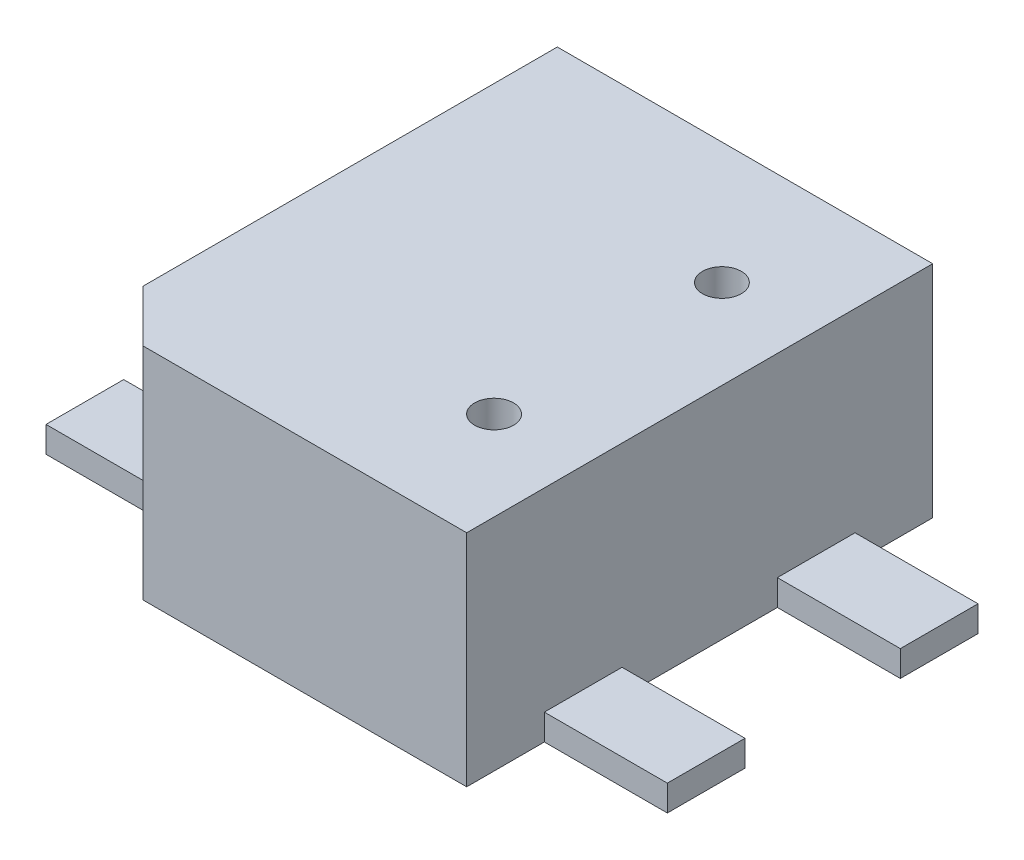
ISO-10303-21;
HEADER;
FILE_DESCRIPTION(('STEP AP214'),'2;1');
FILE_NAME('part.step','',(''),(''),'','','');
FILE_SCHEMA(('AUTOMOTIVE_DESIGN { 1 0 10303 214 1 1 1 1 }'));
ENDSEC;
DATA;
#1=APPLICATION_CONTEXT('core data for automotive mechanical design processes');
#2=APPLICATION_PROTOCOL_DEFINITION('international standard','automotive_design',2000,#1);
#3=PRODUCT_CONTEXT('',#1,'mechanical');
#4=PRODUCT('Part','Part','',(#3));
#5=PRODUCT_RELATED_PRODUCT_CATEGORY('part','',(#4));
#6=PRODUCT_DEFINITION_FORMATION('','',#4);
#7=PRODUCT_DEFINITION_CONTEXT('part definition',#1,'design');
#8=PRODUCT_DEFINITION('design','',#6,#7);
#9=PRODUCT_DEFINITION_SHAPE('','',#8);
#10=(LENGTH_UNIT() NAMED_UNIT(*) SI_UNIT(.MILLI.,.METRE.));
#11=(NAMED_UNIT(*) PLANE_ANGLE_UNIT() SI_UNIT($,.RADIAN.));
#12=(NAMED_UNIT(*) SI_UNIT($,.STERADIAN.) SOLID_ANGLE_UNIT());
#13=UNCERTAINTY_MEASURE_WITH_UNIT(LENGTH_MEASURE(1.E-05),#10,'distance_accuracy_value','');
#14=(GEOMETRIC_REPRESENTATION_CONTEXT(3) GLOBAL_UNCERTAINTY_ASSIGNED_CONTEXT((#13)) GLOBAL_UNIT_ASSIGNED_CONTEXT((#10,
#11,#12)) REPRESENTATION_CONTEXT('',''));
#15=CARTESIAN_POINT('',(0.,0.,0.));
#16=DIRECTION('',(0.,0.,1.));
#17=DIRECTION('',(1.,0.,0.));
#18=AXIS2_PLACEMENT_3D('',#15,#16,#17);
#19=CARTESIAN_POINT('',(-1.45,1.7,-1.8));
#20=DIRECTION('',(1.,0.,0.));
#21=DIRECTION('',(0.,0.,-1.));
#22=AXIS2_PLACEMENT_3D('',#19,#20,#21);
#23=PLANE('',#22);
#24=DIRECTION('',(0.,0.,1.));
#25=VECTOR('',#24,1.);
#26=CARTESIAN_POINT('',(-1.45,0.2,-1.8));
#27=LINE('',#26,#25);
#28=CARTESIAN_POINT('',(-1.45,0.2,0.599999999995748));
#29=VERTEX_POINT('',#28);
#30=CARTESIAN_POINT('',(-1.45,0.2,1.20000000000571));
#31=VERTEX_POINT('',#30);
#32=EDGE_CURVE('E46',#29,#31,#27,.T.);
#33=ORIENTED_EDGE('',*,*,#32,.T.);
#34=DIRECTION('',(0.,-1.,0.));
#35=VECTOR('',#34,1.);
#36=CARTESIAN_POINT('',(-1.45,1.7,1.20000000000571));
#37=LINE('',#36,#35);
#38=CARTESIAN_POINT('',(-1.45,0.,1.20000000000571));
#39=VERTEX_POINT('',#38);
#40=EDGE_CURVE('E230',#31,#39,#37,.T.);
#41=ORIENTED_EDGE('',*,*,#40,.T.);
#42=DIRECTION('',(0.,0.,1.));
#43=VECTOR('',#42,1.);
#44=CARTESIAN_POINT('',(-1.45,0.,-1.8));
#45=LINE('',#44,#43);
#46=CARTESIAN_POINT('',(-1.45,0.,1.40047429049327));
#47=VERTEX_POINT('',#46);
#48=EDGE_CURVE('E291',#39,#47,#45,.T.);
#49=ORIENTED_EDGE('',*,*,#48,.T.);
#50=DIRECTION('',(0.,1.,0.));
#51=VECTOR('',#50,1.);
#52=CARTESIAN_POINT('',(-1.45,1.7,1.40047429049327));
#53=LINE('',#52,#51);
#54=CARTESIAN_POINT('',(-1.45,1.7,1.40047429049327));
#55=VERTEX_POINT('',#54);
#56=EDGE_CURVE('E288',#47,#55,#53,.T.);
#57=ORIENTED_EDGE('',*,*,#56,.T.);
#58=DIRECTION('',(0.,0.,1.));
#59=VECTOR('',#58,1.);
#60=CARTESIAN_POINT('',(-1.45,1.7,-1.8));
#61=LINE('',#60,#59);
#62=CARTESIAN_POINT('',(-1.45,1.7,-1.8));
#63=VERTEX_POINT('',#62);
#64=EDGE_CURVE('E292',#63,#55,#61,.T.);
#65=ORIENTED_EDGE('',*,*,#64,.F.);
#66=DIRECTION('',(0.,-1.,0.));
#67=VECTOR('',#66,1.);
#68=CARTESIAN_POINT('',(-1.45,1.7,-1.8));
#69=LINE('',#68,#67);
#70=CARTESIAN_POINT('',(-1.45,0.,-1.8));
#71=VERTEX_POINT('',#70);
#72=EDGE_CURVE('E302',#63,#71,#69,.T.);
#73=ORIENTED_EDGE('',*,*,#72,.T.);
#74=CARTESIAN_POINT('',(-1.45,0.,-1.20000000000571));
#75=VERTEX_POINT('',#74);
#76=EDGE_CURVE('E303',#71,#75,#45,.T.);
#77=ORIENTED_EDGE('',*,*,#76,.T.);
#78=DIRECTION('',(0.,1.,0.));
#79=VECTOR('',#78,1.);
#80=CARTESIAN_POINT('',(-1.45,1.7,-1.20000000000571));
#81=LINE('',#80,#79);
#82=CARTESIAN_POINT('',(-1.45,0.2,-1.20000000000571));
#83=VERTEX_POINT('',#82);
#84=EDGE_CURVE('E274',#75,#83,#81,.T.);
#85=ORIENTED_EDGE('',*,*,#84,.T.);
#86=DIRECTION('',(0.,0.,1.));
#87=VECTOR('',#86,1.);
#88=CARTESIAN_POINT('',(-1.45,0.2,-1.8));
#89=LINE('',#88,#87);
#90=CARTESIAN_POINT('',(-1.45,0.2,-0.599999999995748));
#91=VERTEX_POINT('',#90);
#92=EDGE_CURVE('E281',#83,#91,#89,.T.);
#93=ORIENTED_EDGE('',*,*,#92,.T.);
#94=DIRECTION('',(0.,-1.,0.));
#95=VECTOR('',#94,1.);
#96=CARTESIAN_POINT('',(-1.45,1.7,-0.599999999995748));
#97=LINE('',#96,#95);
#98=CARTESIAN_POINT('',(-1.45,0.,-0.599999999995748));
#99=VERTEX_POINT('',#98);
#100=EDGE_CURVE('E278',#91,#99,#97,.T.);
#101=ORIENTED_EDGE('',*,*,#100,.T.);
#102=CARTESIAN_POINT('',(-1.45,0.,0.599999999995747));
#103=VERTEX_POINT('',#102);
#104=EDGE_CURVE('E306',#99,#103,#45,.T.);
#105=ORIENTED_EDGE('',*,*,#104,.T.);
#106=DIRECTION('',(0.,1.,0.));
#107=VECTOR('',#106,1.);
#108=CARTESIAN_POINT('',(-1.45,1.7,0.599999999995748));
#109=LINE('',#108,#107);
#110=EDGE_CURVE('E51',#103,#29,#109,.T.);
#111=ORIENTED_EDGE('',*,*,#110,.T.);
#112=EDGE_LOOP('',(#33,#41,#49,#57,#65,#73,#77,#85,#93,#101,#105,#111));
#113=FACE_BOUND('',#112,.T.);
#114=ADVANCED_FACE('F32',(#113),#23,.F.);
#115=CARTESIAN_POINT('',(-1.45,1.7,1.8));
#116=DIRECTION('',(0.,0.,-1.));
#117=DIRECTION('',(-1.,0.,0.));
#118=AXIS2_PLACEMENT_3D('',#115,#116,#117);
#119=PLANE('',#118);
#120=DIRECTION('',(1.,0.,0.));
#121=VECTOR('',#120,1.);
#122=CARTESIAN_POINT('',(-1.45,1.7,1.8));
#123=LINE('',#122,#121);
#124=CARTESIAN_POINT('',(-1.05047429049198,1.7,1.8));
#125=VERTEX_POINT('',#124);
#126=CARTESIAN_POINT('',(1.45,1.7,1.8));
#127=VERTEX_POINT('',#126);
#128=EDGE_CURVE('E295',#125,#127,#123,.T.);
#129=ORIENTED_EDGE('',*,*,#128,.F.);
#130=DIRECTION('',(0.,-1.,0.));
#131=VECTOR('',#130,1.);
#132=CARTESIAN_POINT('',(-1.05047429049198,1.7,1.8));
#133=LINE('',#132,#131);
#134=CARTESIAN_POINT('',(-1.05047429049198,0.,1.8));
#135=VERTEX_POINT('',#134);
#136=EDGE_CURVE('E285',#125,#135,#133,.T.);
#137=ORIENTED_EDGE('',*,*,#136,.T.);
#138=DIRECTION('',(1.,0.,0.));
#139=VECTOR('',#138,1.);
#140=CARTESIAN_POINT('',(-1.45,0.,1.8));
#141=LINE('',#140,#139);
#142=CARTESIAN_POINT('',(1.45,0.,1.8));
#143=VERTEX_POINT('',#142);
#144=EDGE_CURVE('E305',#135,#143,#141,.T.);
#145=ORIENTED_EDGE('',*,*,#144,.T.);
#146=DIRECTION('',(0.,-1.,0.));
#147=VECTOR('',#146,1.);
#148=CARTESIAN_POINT('',(1.45,1.7,1.8));
#149=LINE('',#148,#147);
#150=EDGE_CURVE('E318',#127,#143,#149,.T.);
#151=ORIENTED_EDGE('',*,*,#150,.F.);
#152=EDGE_LOOP('',(#129,#137,#145,#151));
#153=FACE_BOUND('',#152,.T.);
#154=ADVANCED_FACE('F361',(#153),#119,.F.);
#155=CARTESIAN_POINT('',(1.45,1.7,-1.8));
#156=DIRECTION('',(-1.,0.,0.));
#157=DIRECTION('',(0.,0.,1.));
#158=AXIS2_PLACEMENT_3D('',#155,#156,#157);
#159=PLANE('',#158);
#160=DIRECTION('',(0.,0.,-1.));
#161=VECTOR('',#160,1.);
#162=CARTESIAN_POINT('',(1.45,0.,-1.8));
#163=LINE('',#162,#161);
#164=CARTESIAN_POINT('',(1.45,0.,1.20000000000571));
#165=VERTEX_POINT('',#164);
#166=EDGE_CURVE('E309',#143,#165,#163,.T.);
#167=ORIENTED_EDGE('',*,*,#166,.T.);
#168=DIRECTION('',(0.,1.,0.));
#169=VECTOR('',#168,1.);
#170=CARTESIAN_POINT('',(1.45,1.7,1.20000000000571));
#171=LINE('',#170,#169);
#172=CARTESIAN_POINT('',(1.45,0.2,1.20000000000571));
#173=VERTEX_POINT('',#172);
#174=EDGE_CURVE('E228',#165,#173,#171,.T.);
#175=ORIENTED_EDGE('',*,*,#174,.T.);
#176=DIRECTION('',(0.,0.,-1.));
#177=VECTOR('',#176,1.);
#178=CARTESIAN_POINT('',(1.45,0.2,-1.8));
#179=LINE('',#178,#177);
#180=CARTESIAN_POINT('',(1.45,0.2,0.599999999995748));
#181=VERTEX_POINT('',#180);
#182=EDGE_CURVE('E11',#173,#181,#179,.T.);
#183=ORIENTED_EDGE('',*,*,#182,.T.);
#184=DIRECTION('',(0.,-1.,0.));
#185=VECTOR('',#184,1.);
#186=CARTESIAN_POINT('',(1.45,1.7,0.599999999995748));
#187=LINE('',#186,#185);
#188=CARTESIAN_POINT('',(1.45,0.,0.599999999995748));
#189=VERTEX_POINT('',#188);
#190=EDGE_CURVE('E220',#181,#189,#187,.T.);
#191=ORIENTED_EDGE('',*,*,#190,.T.);
#192=CARTESIAN_POINT('',(1.45,0.,-0.599999999995748));
#193=VERTEX_POINT('',#192);
#194=EDGE_CURVE('E311',#189,#193,#163,.T.);
#195=ORIENTED_EDGE('',*,*,#194,.T.);
#196=DIRECTION('',(0.,1.,0.));
#197=VECTOR('',#196,1.);
#198=CARTESIAN_POINT('',(1.45,1.7,-0.599999999995748));
#199=LINE('',#198,#197);
#200=CARTESIAN_POINT('',(1.45,0.2,-0.599999999995748));
#201=VERTEX_POINT('',#200);
#202=EDGE_CURVE('E276',#193,#201,#199,.T.);
#203=ORIENTED_EDGE('',*,*,#202,.T.);
#204=DIRECTION('',(0.,0.,-1.));
#205=VECTOR('',#204,1.);
#206=CARTESIAN_POINT('',(1.45,0.2,-1.8));
#207=LINE('',#206,#205);
#208=CARTESIAN_POINT('',(1.45,0.2,-1.20000000000571));
#209=VERTEX_POINT('',#208);
#210=EDGE_CURVE('E39',#201,#209,#207,.T.);
#211=ORIENTED_EDGE('',*,*,#210,.T.);
#212=DIRECTION('',(0.,-1.,0.));
#213=VECTOR('',#212,1.);
#214=CARTESIAN_POINT('',(1.45,1.7,-1.20000000000571));
#215=LINE('',#214,#213);
#216=CARTESIAN_POINT('',(1.45,0.,-1.20000000000571));
#217=VERTEX_POINT('',#216);
#218=EDGE_CURVE('E265',#209,#217,#215,.T.);
#219=ORIENTED_EDGE('',*,*,#218,.T.);
#220=CARTESIAN_POINT('',(1.45,0.,-1.8));
#221=VERTEX_POINT('',#220);
#222=EDGE_CURVE('E308',#217,#221,#163,.T.);
#223=ORIENTED_EDGE('',*,*,#222,.T.);
#224=DIRECTION('',(0.,-1.,0.));
#225=VECTOR('',#224,1.);
#226=CARTESIAN_POINT('',(1.45,1.7,-1.8));
#227=LINE('',#226,#225);
#228=CARTESIAN_POINT('',(1.45,1.7,-1.8));
#229=VERTEX_POINT('',#228);
#230=EDGE_CURVE('E315',#229,#221,#227,.T.);
#231=ORIENTED_EDGE('',*,*,#230,.F.);
#232=DIRECTION('',(0.,0.,-1.));
#233=VECTOR('',#232,1.);
#234=CARTESIAN_POINT('',(1.45,1.7,-1.8));
#235=LINE('',#234,#233);
#236=EDGE_CURVE('E298',#127,#229,#235,.T.);
#237=ORIENTED_EDGE('',*,*,#236,.F.);
#238=ORIENTED_EDGE('',*,*,#150,.T.);
#239=EDGE_LOOP('',(#167,#175,#183,#191,#195,#203,#211,#219,#223,#231,#237,#238));
#240=FACE_BOUND('',#239,.T.);
#241=ADVANCED_FACE('F326',(#240),#159,.F.);
#242=CARTESIAN_POINT('',(-1.45,1.7,-1.8));
#243=DIRECTION('',(0.,0.,1.));
#244=DIRECTION('',(1.,0.,0.));
#245=AXIS2_PLACEMENT_3D('',#242,#243,#244);
#246=PLANE('',#245);
#247=DIRECTION('',(-1.,0.,0.));
#248=VECTOR('',#247,1.);
#249=CARTESIAN_POINT('',(-1.45,0.,-1.8));
#250=LINE('',#249,#248);
#251=EDGE_CURVE('E296',#221,#71,#250,.T.);
#252=ORIENTED_EDGE('',*,*,#251,.T.);
#253=ORIENTED_EDGE('',*,*,#72,.F.);
#254=DIRECTION('',(-1.,0.,0.));
#255=VECTOR('',#254,1.);
#256=CARTESIAN_POINT('',(-1.45,1.7,-1.8));
#257=LINE('',#256,#255);
#258=EDGE_CURVE('E300',#229,#63,#257,.T.);
#259=ORIENTED_EDGE('',*,*,#258,.F.);
#260=ORIENTED_EDGE('',*,*,#230,.T.);
#261=EDGE_LOOP('',(#252,#253,#259,#260));
#262=FACE_BOUND('',#261,.T.);
#263=ADVANCED_FACE('F371',(#262),#246,.F.);
#264=CARTESIAN_POINT('',(0.,1.7,0.));
#265=DIRECTION('',(0.,1.,0.));
#266=DIRECTION('',(0.,0.,1.));
#267=AXIS2_PLACEMENT_3D('',#264,#265,#266);
#268=PLANE('',#267);
#269=CARTESIAN_POINT('',(0.761620279617557,1.7,0.900000000000728));
#270=DIRECTION('',(0.,1.,0.));
#271=DIRECTION('',(0.,0.,1.));
#272=AXIS2_PLACEMENT_3D('',#269,#270,#271);
#273=CIRCLE('',#272,0.15);
#274=CARTESIAN_POINT('',(0.761620279617557,1.7,1.05000000000073));
#275=VERTEX_POINT('',#274);
#276=EDGE_CURVE('E433',#275,#275,#273,.T.);
#277=ORIENTED_EDGE('',*,*,#276,.F.);
#278=EDGE_LOOP('',(#277));
#279=FACE_BOUND('',#278,.T.);
#280=CARTESIAN_POINT('',(0.761620279617557,1.7,-0.86));
#281=DIRECTION('',(0.,1.,0.));
#282=DIRECTION('',(0.,0.,1.));
#283=AXIS2_PLACEMENT_3D('',#280,#281,#282);
#284=CIRCLE('',#283,0.15);
#285=CARTESIAN_POINT('',(0.761620279617557,1.7,-0.71));
#286=VERTEX_POINT('',#285);
#287=EDGE_CURVE('E203',#286,#286,#284,.T.);
#288=ORIENTED_EDGE('',*,*,#287,.F.);
#289=EDGE_LOOP('',(#288));
#290=FACE_BOUND('',#289,.T.);
#291=DIRECTION('',(-0.707106781187696,0.,-0.707106781185399));
#292=VECTOR('',#291,1.);
#293=CARTESIAN_POINT('',(-1.45047429049328,1.7,1.4));
#294=LINE('',#293,#292);
#295=EDGE_CURVE('E283',#125,#55,#294,.T.);
#296=ORIENTED_EDGE('',*,*,#295,.F.);
#297=ORIENTED_EDGE('',*,*,#128,.T.);
#298=ORIENTED_EDGE('',*,*,#236,.T.);
#299=ORIENTED_EDGE('',*,*,#258,.T.);
#300=ORIENTED_EDGE('',*,*,#64,.T.);
#301=EDGE_LOOP('',(#296,#297,#298,#299,#300));
#302=FACE_BOUND('',#301,.T.);
#303=ADVANCED_FACE('F377',(#279,#290,#302),#268,.T.);
#304=CARTESIAN_POINT('',(0.,0.,0.));
#305=DIRECTION('',(0.,1.,0.));
#306=DIRECTION('',(0.,0.,1.));
#307=AXIS2_PLACEMENT_3D('',#304,#305,#306);
#308=PLANE('',#307);
#309=CARTESIAN_POINT('',(0.761620279617557,0.,0.900000000000728));
#310=DIRECTION('',(0.,1.,0.));
#311=DIRECTION('',(0.,0.,1.));
#312=AXIS2_PLACEMENT_3D('',#309,#310,#311);
#313=CIRCLE('',#312,0.15);
#314=CARTESIAN_POINT('',(0.761620279617557,0.,1.05000000000073));
#315=VERTEX_POINT('',#314);
#316=EDGE_CURVE('E430',#315,#315,#313,.T.);
#317=ORIENTED_EDGE('',*,*,#316,.T.);
#318=EDGE_LOOP('',(#317));
#319=FACE_BOUND('',#318,.T.);
#320=CARTESIAN_POINT('',(0.761620279617557,0.,-0.86));
#321=DIRECTION('',(0.,1.,0.));
#322=DIRECTION('',(0.,0.,1.));
#323=AXIS2_PLACEMENT_3D('',#320,#321,#322);
#324=CIRCLE('',#323,0.15);
#325=CARTESIAN_POINT('',(0.761620279617557,0.,-0.71));
#326=VERTEX_POINT('',#325);
#327=EDGE_CURVE('E214',#326,#326,#324,.T.);
#328=ORIENTED_EDGE('',*,*,#327,.T.);
#329=EDGE_LOOP('',(#328));
#330=FACE_BOUND('',#329,.T.);
#331=ORIENTED_EDGE('',*,*,#194,.F.);
#332=DIRECTION('',(1.,0.,0.));
#333=VECTOR('',#332,1.);
#334=CARTESIAN_POINT('',(-2.3999999999972,0.,0.599999999995748));
#335=LINE('',#334,#333);
#336=CARTESIAN_POINT('',(2.3999999999972,0.,0.599999999995748));
#337=VERTEX_POINT('',#336);
#338=EDGE_CURVE('E213',#189,#337,#335,.T.);
#339=ORIENTED_EDGE('',*,*,#338,.T.);
#340=DIRECTION('',(0.,0.,1.));
#341=VECTOR('',#340,1.);
#342=CARTESIAN_POINT('',(2.3999999999972,0.,0.599999999995748));
#343=LINE('',#342,#341);
#344=CARTESIAN_POINT('',(2.3999999999972,0.,1.20000000000571));
#345=VERTEX_POINT('',#344);
#346=EDGE_CURVE('E216',#337,#345,#343,.T.);
#347=ORIENTED_EDGE('',*,*,#346,.T.);
#348=DIRECTION('',(-1.,0.,0.));
#349=VECTOR('',#348,1.);
#350=CARTESIAN_POINT('',(-2.3999999999972,0.,1.20000000000571));
#351=LINE('',#350,#349);
#352=EDGE_CURVE('E197',#345,#165,#351,.T.);
#353=ORIENTED_EDGE('',*,*,#352,.T.);
#354=ORIENTED_EDGE('',*,*,#166,.F.);
#355=ORIENTED_EDGE('',*,*,#144,.F.);
#356=DIRECTION('',(-0.707106781187696,0.,-0.7071067811854));
#357=VECTOR('',#356,1.);
#358=CARTESIAN_POINT('',(-1.42523714524428,0.,1.42523714524891));
#359=LINE('',#358,#357);
#360=EDGE_CURVE('E321',#135,#47,#359,.T.);
#361=ORIENTED_EDGE('',*,*,#360,.T.);
#362=ORIENTED_EDGE('',*,*,#48,.F.);
#363=CARTESIAN_POINT('',(-2.3999999999972,0.,1.20000000000571));
#364=VERTEX_POINT('',#363);
#365=EDGE_CURVE('E200',#39,#364,#351,.T.);
#366=ORIENTED_EDGE('',*,*,#365,.T.);
#367=DIRECTION('',(0.,0.,-1.));
#368=VECTOR('',#367,1.);
#369=CARTESIAN_POINT('',(-2.3999999999972,0.,0.599999999995748));
#370=LINE('',#369,#368);
#371=CARTESIAN_POINT('',(-2.3999999999972,0.,0.599999999995748));
#372=VERTEX_POINT('',#371);
#373=EDGE_CURVE('E211',#364,#372,#370,.T.);
#374=ORIENTED_EDGE('',*,*,#373,.T.);
#375=EDGE_CURVE('E177',#372,#103,#335,.T.);
#376=ORIENTED_EDGE('',*,*,#375,.T.);
#377=ORIENTED_EDGE('',*,*,#104,.F.);
#378=DIRECTION('',(-1.,0.,0.));
#379=VECTOR('',#378,1.);
#380=CARTESIAN_POINT('',(-2.3999999999972,0.,-0.599999999995748));
#381=LINE('',#380,#379);
#382=CARTESIAN_POINT('',(-2.3999999999972,0.,-0.599999999995748));
#383=VERTEX_POINT('',#382);
#384=EDGE_CURVE('E259',#99,#383,#381,.T.);
#385=ORIENTED_EDGE('',*,*,#384,.T.);
#386=DIRECTION('',(0.,0.,-1.));
#387=VECTOR('',#386,1.);
#388=CARTESIAN_POINT('',(-2.3999999999972,0.,-1.20000000000571));
#389=LINE('',#388,#387);
#390=CARTESIAN_POINT('',(-2.3999999999972,0.,-1.20000000000571));
#391=VERTEX_POINT('',#390);
#392=EDGE_CURVE('E233',#383,#391,#389,.T.);
#393=ORIENTED_EDGE('',*,*,#392,.T.);
#394=DIRECTION('',(1.,0.,0.));
#395=VECTOR('',#394,1.);
#396=CARTESIAN_POINT('',(-2.3999999999972,0.,-1.20000000000571));
#397=LINE('',#396,#395);
#398=EDGE_CURVE('E253',#391,#75,#397,.T.);
#399=ORIENTED_EDGE('',*,*,#398,.T.);
#400=ORIENTED_EDGE('',*,*,#76,.F.);
#401=ORIENTED_EDGE('',*,*,#251,.F.);
#402=ORIENTED_EDGE('',*,*,#222,.F.);
#403=CARTESIAN_POINT('',(2.3999999999972,0.,-1.20000000000571));
#404=VERTEX_POINT('',#403);
#405=EDGE_CURVE('E252',#217,#404,#397,.T.);
#406=ORIENTED_EDGE('',*,*,#405,.T.);
#407=DIRECTION('',(0.,0.,1.));
#408=VECTOR('',#407,1.);
#409=CARTESIAN_POINT('',(2.3999999999972,0.,-1.20000000000571));
#410=LINE('',#409,#408);
#411=CARTESIAN_POINT('',(2.3999999999972,0.,-0.599999999995748));
#412=VERTEX_POINT('',#411);
#413=EDGE_CURVE('E256',#404,#412,#410,.T.);
#414=ORIENTED_EDGE('',*,*,#413,.T.);
#415=EDGE_CURVE('E238',#412,#193,#381,.T.);
#416=ORIENTED_EDGE('',*,*,#415,.T.);
#417=EDGE_LOOP('',(#331,#339,#347,#353,#354,#355,#361,#362,#366,#374,#376,#377,#385,#393,#399,
#400,#401,#402,#406,#414,#416));
#418=FACE_BOUND('',#417,.T.);
#419=ADVANCED_FACE('F342',(#319,#330,#418),#308,.F.);
#420=CARTESIAN_POINT('',(-1.45047429049328,0.,1.4));
#421=DIRECTION('',(0.707106781185399,0.,-0.707106781187695));
#422=DIRECTION('',(-0.707106781187696,0.,-0.7071067811854));
#423=AXIS2_PLACEMENT_3D('',#420,#421,#422);
#424=PLANE('',#423);
#425=ORIENTED_EDGE('',*,*,#360,.F.);
#426=ORIENTED_EDGE('',*,*,#136,.F.);
#427=ORIENTED_EDGE('',*,*,#295,.T.);
#428=ORIENTED_EDGE('',*,*,#56,.F.);
#429=EDGE_LOOP('',(#425,#426,#427,#428));
#430=FACE_BOUND('',#429,.T.);
#431=ADVANCED_FACE('F381',(#430),#424,.F.);
#432=CARTESIAN_POINT('',(2.3999999999972,0.2,-1.20000000000571));
#433=DIRECTION('',(1.,0.,0.));
#434=DIRECTION('',(0.,0.,-1.));
#435=AXIS2_PLACEMENT_3D('',#432,#433,#434);
#436=PLANE('',#435);
#437=ORIENTED_EDGE('',*,*,#413,.F.);
#438=DIRECTION('',(0.,-1.,0.));
#439=VECTOR('',#438,1.);
#440=CARTESIAN_POINT('',(2.3999999999972,0.2,-1.20000000000571));
#441=LINE('',#440,#439);
#442=CARTESIAN_POINT('',(2.3999999999972,0.2,-1.20000000000571));
#443=VERTEX_POINT('',#442);
#444=EDGE_CURVE('E268',#443,#404,#441,.T.);
#445=ORIENTED_EDGE('',*,*,#444,.F.);
#446=DIRECTION('',(0.,0.,1.));
#447=VECTOR('',#446,1.);
#448=CARTESIAN_POINT('',(2.3999999999972,0.2,-1.20000000000571));
#449=LINE('',#448,#447);
#450=CARTESIAN_POINT('',(2.3999999999972,0.2,-0.599999999995748));
#451=VERTEX_POINT('',#450);
#452=EDGE_CURVE('E242',#443,#451,#449,.T.);
#453=ORIENTED_EDGE('',*,*,#452,.T.);
#454=DIRECTION('',(0.,-1.,0.));
#455=VECTOR('',#454,1.);
#456=CARTESIAN_POINT('',(2.3999999999972,0.2,-0.599999999995748));
#457=LINE('',#456,#455);
#458=EDGE_CURVE('E266',#451,#412,#457,.T.);
#459=ORIENTED_EDGE('',*,*,#458,.T.);
#460=EDGE_LOOP('',(#437,#445,#453,#459));
#461=FACE_BOUND('',#460,.T.);
#462=ADVANCED_FACE('F339',(#461),#436,.T.);
#463=CARTESIAN_POINT('',(0.,0.2,0.));
#464=DIRECTION('',(0.,1.,0.));
#465=DIRECTION('',(0.,0.,1.));
#466=AXIS2_PLACEMENT_3D('',#463,#464,#465);
#467=PLANE('',#466);
#468=ORIENTED_EDGE('',*,*,#210,.F.);
#469=DIRECTION('',(-1.,0.,0.));
#470=VECTOR('',#469,1.);
#471=CARTESIAN_POINT('',(-2.3999999999972,0.2,-0.599999999995748));
#472=LINE('',#471,#470);
#473=EDGE_CURVE('E246',#451,#201,#472,.T.);
#474=ORIENTED_EDGE('',*,*,#473,.F.);
#475=ORIENTED_EDGE('',*,*,#452,.F.);
#476=DIRECTION('',(1.,0.,0.));
#477=VECTOR('',#476,1.);
#478=CARTESIAN_POINT('',(-2.3999999999972,0.2,-1.20000000000571));
#479=LINE('',#478,#477);
#480=EDGE_CURVE('E237',#209,#443,#479,.T.);
#481=ORIENTED_EDGE('',*,*,#480,.F.);
#482=EDGE_LOOP('',(#468,#474,#475,#481));
#483=FACE_BOUND('',#482,.T.);
#484=ADVANCED_FACE('F336',(#483),#467,.T.);
#485=CARTESIAN_POINT('',(-2.3999999999972,0.2,-1.20000000000571));
#486=DIRECTION('',(0.,0.,-1.));
#487=DIRECTION('',(-1.,0.,0.));
#488=AXIS2_PLACEMENT_3D('',#485,#486,#487);
#489=PLANE('',#488);
#490=ORIENTED_EDGE('',*,*,#218,.F.);
#491=ORIENTED_EDGE('',*,*,#480,.T.);
#492=ORIENTED_EDGE('',*,*,#444,.T.);
#493=ORIENTED_EDGE('',*,*,#405,.F.);
#494=EDGE_LOOP('',(#490,#491,#492,#493));
#495=FACE_BOUND('',#494,.T.);
#496=ADVANCED_FACE('F333',(#495),#489,.T.);
#497=CARTESIAN_POINT('',(-2.3999999999972,0.2,-0.599999999995748));
#498=DIRECTION('',(0.,0.,1.));
#499=DIRECTION('',(1.,0.,0.));
#500=AXIS2_PLACEMENT_3D('',#497,#498,#499);
#501=PLANE('',#500);
#502=ORIENTED_EDGE('',*,*,#202,.F.);
#503=ORIENTED_EDGE('',*,*,#415,.F.);
#504=ORIENTED_EDGE('',*,*,#458,.F.);
#505=ORIENTED_EDGE('',*,*,#473,.T.);
#506=EDGE_LOOP('',(#502,#503,#504,#505));
#507=FACE_BOUND('',#506,.T.);
#508=ADVANCED_FACE('F344',(#507),#501,.T.);
#509=ORIENTED_EDGE('',*,*,#92,.F.);
#510=CARTESIAN_POINT('',(-2.3999999999972,0.2,-1.20000000000571));
#511=VERTEX_POINT('',#510);
#512=EDGE_CURVE('E239',#511,#83,#479,.T.);
#513=ORIENTED_EDGE('',*,*,#512,.F.);
#514=DIRECTION('',(0.,0.,-1.));
#515=VECTOR('',#514,1.);
#516=CARTESIAN_POINT('',(-2.3999999999972,0.2,-1.20000000000571));
#517=LINE('',#516,#515);
#518=CARTESIAN_POINT('',(-2.3999999999972,0.2,-0.599999999995748));
#519=VERTEX_POINT('',#518);
#520=EDGE_CURVE('E234',#519,#511,#517,.T.);
#521=ORIENTED_EDGE('',*,*,#520,.F.);
#522=EDGE_CURVE('E245',#91,#519,#472,.T.);
#523=ORIENTED_EDGE('',*,*,#522,.F.);
#524=EDGE_LOOP('',(#509,#513,#521,#523));
#525=FACE_BOUND('',#524,.T.);
#526=ADVANCED_FACE('F346',(#525),#467,.T.);
#527=ORIENTED_EDGE('',*,*,#100,.F.);
#528=ORIENTED_EDGE('',*,*,#522,.T.);
#529=DIRECTION('',(0.,-1.,0.));
#530=VECTOR('',#529,1.);
#531=CARTESIAN_POINT('',(-2.3999999999972,0.2,-0.599999999995748));
#532=LINE('',#531,#530);
#533=EDGE_CURVE('E262',#519,#383,#532,.T.);
#534=ORIENTED_EDGE('',*,*,#533,.T.);
#535=ORIENTED_EDGE('',*,*,#384,.F.);
#536=EDGE_LOOP('',(#527,#528,#534,#535));
#537=FACE_BOUND('',#536,.T.);
#538=ADVANCED_FACE('F348',(#537),#501,.T.);
#539=ORIENTED_EDGE('',*,*,#84,.F.);
#540=ORIENTED_EDGE('',*,*,#398,.F.);
#541=DIRECTION('',(0.,-1.,0.));
#542=VECTOR('',#541,1.);
#543=CARTESIAN_POINT('',(-2.3999999999972,0.2,-1.20000000000571));
#544=LINE('',#543,#542);
#545=EDGE_CURVE('E249',#511,#391,#544,.T.);
#546=ORIENTED_EDGE('',*,*,#545,.F.);
#547=ORIENTED_EDGE('',*,*,#512,.T.);
#548=EDGE_LOOP('',(#539,#540,#546,#547));
#549=FACE_BOUND('',#548,.T.);
#550=ADVANCED_FACE('F356',(#549),#489,.T.);
#551=CARTESIAN_POINT('',(-2.3999999999972,0.2,-1.20000000000571));
#552=DIRECTION('',(-1.,0.,0.));
#553=DIRECTION('',(0.,0.,1.));
#554=AXIS2_PLACEMENT_3D('',#551,#552,#553);
#555=PLANE('',#554);
#556=ORIENTED_EDGE('',*,*,#392,.F.);
#557=ORIENTED_EDGE('',*,*,#533,.F.);
#558=ORIENTED_EDGE('',*,*,#520,.T.);
#559=ORIENTED_EDGE('',*,*,#545,.T.);
#560=EDGE_LOOP('',(#556,#557,#558,#559));
#561=FACE_BOUND('',#560,.T.);
#562=ADVANCED_FACE('F389',(#561),#555,.T.);
#563=CARTESIAN_POINT('',(2.3999999999972,0.2,0.599999999995748));
#564=DIRECTION('',(1.,0.,0.));
#565=DIRECTION('',(0.,0.,-1.));
#566=AXIS2_PLACEMENT_3D('',#563,#564,#565);
#567=PLANE('',#566);
#568=ORIENTED_EDGE('',*,*,#346,.F.);
#569=DIRECTION('',(0.,-1.,0.));
#570=VECTOR('',#569,1.);
#571=CARTESIAN_POINT('',(2.3999999999972,0.2,0.599999999995748));
#572=LINE('',#571,#570);
#573=CARTESIAN_POINT('',(2.3999999999972,0.2,0.599999999995748));
#574=VERTEX_POINT('',#573);
#575=EDGE_CURVE('E182',#574,#337,#572,.T.);
#576=ORIENTED_EDGE('',*,*,#575,.F.);
#577=DIRECTION('',(0.,0.,1.));
#578=VECTOR('',#577,1.);
#579=CARTESIAN_POINT('',(2.3999999999972,0.2,0.599999999995748));
#580=LINE('',#579,#578);
#581=CARTESIAN_POINT('',(2.3999999999972,0.2,1.20000000000571));
#582=VERTEX_POINT('',#581);
#583=EDGE_CURVE('E190',#574,#582,#580,.T.);
#584=ORIENTED_EDGE('',*,*,#583,.T.);
#585=DIRECTION('',(0.,-1.,0.));
#586=VECTOR('',#585,1.);
#587=CARTESIAN_POINT('',(2.3999999999972,0.2,1.20000000000571));
#588=LINE('',#587,#586);
#589=EDGE_CURVE('E221',#582,#345,#588,.T.);
#590=ORIENTED_EDGE('',*,*,#589,.T.);
#591=EDGE_LOOP('',(#568,#576,#584,#590));
#592=FACE_BOUND('',#591,.T.);
#593=ADVANCED_FACE('F391',(#592),#567,.T.);
#594=CARTESIAN_POINT('',(0.,0.2,0.));
#595=DIRECTION('',(0.,1.,0.));
#596=DIRECTION('',(0.,0.,1.));
#597=AXIS2_PLACEMENT_3D('',#594,#595,#596);
#598=PLANE('',#597);
#599=ORIENTED_EDGE('',*,*,#182,.F.);
#600=DIRECTION('',(-1.,0.,0.));
#601=VECTOR('',#600,1.);
#602=CARTESIAN_POINT('',(-2.3999999999972,0.2,1.20000000000571));
#603=LINE('',#602,#601);
#604=EDGE_CURVE('E183',#582,#173,#603,.T.);
#605=ORIENTED_EDGE('',*,*,#604,.F.);
#606=ORIENTED_EDGE('',*,*,#583,.F.);
#607=DIRECTION('',(1.,0.,0.));
#608=VECTOR('',#607,1.);
#609=CARTESIAN_POINT('',(-2.3999999999972,0.2,0.599999999995748));
#610=LINE('',#609,#608);
#611=EDGE_CURVE('E191',#181,#574,#610,.T.);
#612=ORIENTED_EDGE('',*,*,#611,.F.);
#613=EDGE_LOOP('',(#599,#605,#606,#612));
#614=FACE_BOUND('',#613,.T.);
#615=ADVANCED_FACE('F411',(#614),#598,.T.);
#616=CARTESIAN_POINT('',(-2.3999999999972,0.2,0.599999999995748));
#617=DIRECTION('',(0.,0.,-1.));
#618=DIRECTION('',(-1.,0.,0.));
#619=AXIS2_PLACEMENT_3D('',#616,#617,#618);
#620=PLANE('',#619);
#621=ORIENTED_EDGE('',*,*,#190,.F.);
#622=ORIENTED_EDGE('',*,*,#611,.T.);
#623=ORIENTED_EDGE('',*,*,#575,.T.);
#624=ORIENTED_EDGE('',*,*,#338,.F.);
#625=EDGE_LOOP('',(#621,#622,#623,#624));
#626=FACE_BOUND('',#625,.T.);
#627=ADVANCED_FACE('F408',(#626),#620,.T.);
#628=CARTESIAN_POINT('',(-2.3999999999972,0.2,1.20000000000571));
#629=DIRECTION('',(0.,0.,1.));
#630=DIRECTION('',(1.,0.,0.));
#631=AXIS2_PLACEMENT_3D('',#628,#629,#630);
#632=PLANE('',#631);
#633=ORIENTED_EDGE('',*,*,#174,.F.);
#634=ORIENTED_EDGE('',*,*,#352,.F.);
#635=ORIENTED_EDGE('',*,*,#589,.F.);
#636=ORIENTED_EDGE('',*,*,#604,.T.);
#637=EDGE_LOOP('',(#633,#634,#635,#636));
#638=FACE_BOUND('',#637,.T.);
#639=ADVANCED_FACE('F416',(#638),#632,.T.);
#640=ORIENTED_EDGE('',*,*,#32,.F.);
#641=CARTESIAN_POINT('',(-2.3999999999972,0.2,0.599999999995748));
#642=VERTEX_POINT('',#641);
#643=EDGE_CURVE('E175',#642,#29,#610,.T.);
#644=ORIENTED_EDGE('',*,*,#643,.F.);
#645=DIRECTION('',(0.,0.,-1.));
#646=VECTOR('',#645,1.);
#647=CARTESIAN_POINT('',(-2.3999999999972,0.2,0.599999999995748));
#648=LINE('',#647,#646);
#649=CARTESIAN_POINT('',(-2.3999999999972,0.2,1.20000000000571));
#650=VERTEX_POINT('',#649);
#651=EDGE_CURVE('E189',#650,#642,#648,.T.);
#652=ORIENTED_EDGE('',*,*,#651,.F.);
#653=EDGE_CURVE('E208',#31,#650,#603,.T.);
#654=ORIENTED_EDGE('',*,*,#653,.F.);
#655=EDGE_LOOP('',(#640,#644,#652,#654));
#656=FACE_BOUND('',#655,.T.);
#657=ADVANCED_FACE('F187',(#656),#598,.T.);
#658=ORIENTED_EDGE('',*,*,#40,.F.);
#659=ORIENTED_EDGE('',*,*,#653,.T.);
#660=DIRECTION('',(0.,-1.,0.));
#661=VECTOR('',#660,1.);
#662=CARTESIAN_POINT('',(-2.3999999999972,0.2,1.20000000000571));
#663=LINE('',#662,#661);
#664=EDGE_CURVE('E196',#650,#364,#663,.T.);
#665=ORIENTED_EDGE('',*,*,#664,.T.);
#666=ORIENTED_EDGE('',*,*,#365,.F.);
#667=EDGE_LOOP('',(#658,#659,#665,#666));
#668=FACE_BOUND('',#667,.T.);
#669=ADVANCED_FACE('F407',(#668),#632,.T.);
#670=ORIENTED_EDGE('',*,*,#110,.F.);
#671=ORIENTED_EDGE('',*,*,#375,.F.);
#672=DIRECTION('',(0.,-1.,0.));
#673=VECTOR('',#672,1.);
#674=CARTESIAN_POINT('',(-2.3999999999972,0.2,0.599999999995748));
#675=LINE('',#674,#673);
#676=EDGE_CURVE('E172',#642,#372,#675,.T.);
#677=ORIENTED_EDGE('',*,*,#676,.F.);
#678=ORIENTED_EDGE('',*,*,#643,.T.);
#679=EDGE_LOOP('',(#670,#671,#677,#678));
#680=FACE_BOUND('',#679,.T.);
#681=ADVANCED_FACE('F174',(#680),#620,.T.);
#682=CARTESIAN_POINT('',(-2.3999999999972,0.2,0.599999999995748));
#683=DIRECTION('',(-1.,0.,0.));
#684=DIRECTION('',(0.,0.,1.));
#685=AXIS2_PLACEMENT_3D('',#682,#683,#684);
#686=PLANE('',#685);
#687=ORIENTED_EDGE('',*,*,#373,.F.);
#688=ORIENTED_EDGE('',*,*,#664,.F.);
#689=ORIENTED_EDGE('',*,*,#651,.T.);
#690=ORIENTED_EDGE('',*,*,#676,.T.);
#691=EDGE_LOOP('',(#687,#688,#689,#690));
#692=FACE_BOUND('',#691,.T.);
#693=ADVANCED_FACE('F194',(#692),#686,.T.);
#694=CARTESIAN_POINT('',(0.761620279617557,0.,-0.86));
#695=DIRECTION('',(0.,1.,0.));
#696=DIRECTION('',(0.,0.,1.));
#697=AXIS2_PLACEMENT_3D('',#694,#695,#696);
#698=CYLINDRICAL_SURFACE('',#697,0.15);
#699=ORIENTED_EDGE('',*,*,#327,.F.);
#700=EDGE_LOOP('',(#699));
#701=FACE_BOUND('',#700,.T.);
#702=ORIENTED_EDGE('',*,*,#287,.T.);
#703=EDGE_LOOP('',(#702));
#704=FACE_BOUND('',#703,.T.);
#705=ADVANCED_FACE('F404',(#701,#704),#698,.F.);
#706=CARTESIAN_POINT('',(0.761620279617557,0.,0.900000000000728));
#707=DIRECTION('',(0.,1.,0.));
#708=DIRECTION('',(0.,0.,1.));
#709=AXIS2_PLACEMENT_3D('',#706,#707,#708);
#710=CYLINDRICAL_SURFACE('',#709,0.15);
#711=ORIENTED_EDGE('',*,*,#316,.F.);
#712=EDGE_LOOP('',(#711));
#713=FACE_BOUND('',#712,.T.);
#714=ORIENTED_EDGE('',*,*,#276,.T.);
#715=EDGE_LOOP('',(#714));
#716=FACE_BOUND('',#715,.T.);
#717=ADVANCED_FACE('F421',(#713,#716),#710,.F.);
#718=CLOSED_SHELL('',(#114,#154,#241,#263,#303,#419,#431,#462,#484,#496,#508,#526,#538,#550,
#562,#593,#615,#627,#639,#657,#669,#681,#693,#705,#717));
#719=MANIFOLD_SOLID_BREP('B2',#718);
#720=ADVANCED_BREP_SHAPE_REPRESENTATION('',(#18,#719),#14);
#721=SHAPE_DEFINITION_REPRESENTATION(#9,#720);
ENDSEC;
END-ISO-10303-21;
